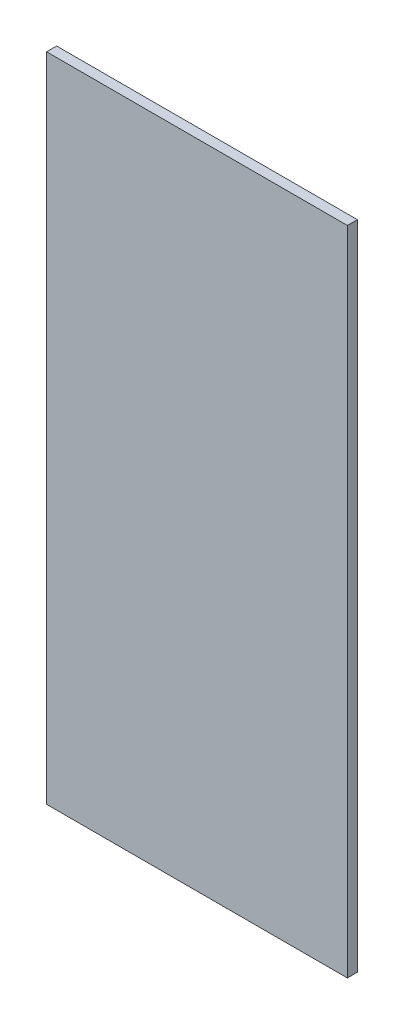
ISO-10303-21;
HEADER;
FILE_DESCRIPTION(('STEP AP214'),'2;1');
FILE_NAME('part.step','',(''),(''),'','','');
FILE_SCHEMA(('AUTOMOTIVE_DESIGN { 1 0 10303 214 1 1 1 1 }'));
ENDSEC;
DATA;
#1=APPLICATION_CONTEXT('core data for automotive mechanical design processes');
#2=APPLICATION_PROTOCOL_DEFINITION('international standard','automotive_design',2000,#1);
#3=PRODUCT_CONTEXT('',#1,'mechanical');
#4=PRODUCT('Part','Part','',(#3));
#5=PRODUCT_RELATED_PRODUCT_CATEGORY('part','',(#4));
#6=PRODUCT_DEFINITION_FORMATION('','',#4);
#7=PRODUCT_DEFINITION_CONTEXT('part definition',#1,'design');
#8=PRODUCT_DEFINITION('design','',#6,#7);
#9=PRODUCT_DEFINITION_SHAPE('','',#8);
#10=(LENGTH_UNIT() NAMED_UNIT(*) SI_UNIT(.MILLI.,.METRE.));
#11=(NAMED_UNIT(*) PLANE_ANGLE_UNIT() SI_UNIT($,.RADIAN.));
#12=(NAMED_UNIT(*) SI_UNIT($,.STERADIAN.) SOLID_ANGLE_UNIT());
#13=UNCERTAINTY_MEASURE_WITH_UNIT(LENGTH_MEASURE(1.E-05),#10,'distance_accuracy_value','');
#14=(GEOMETRIC_REPRESENTATION_CONTEXT(3) GLOBAL_UNCERTAINTY_ASSIGNED_CONTEXT((#13)) GLOBAL_UNIT_ASSIGNED_CONTEXT((#10,
#11,#12)) REPRESENTATION_CONTEXT('',''));
#15=CARTESIAN_POINT('',(0.,0.,0.));
#16=DIRECTION('',(0.,0.,1.));
#17=DIRECTION('',(1.,0.,0.));
#18=AXIS2_PLACEMENT_3D('',#15,#16,#17);
#19=CARTESIAN_POINT('',(0.,82.55,1.27));
#20=DIRECTION('',(-1.,0.,0.));
#21=DIRECTION('',(0.,-1.,0.));
#22=AXIS2_PLACEMENT_3D('',#19,#20,#21);
#23=PLANE('',#22);
#24=DIRECTION('',(0.,1.,0.));
#25=VECTOR('',#24,1.);
#26=CARTESIAN_POINT('',(0.,82.55,0.));
#27=LINE('',#26,#25);
#28=CARTESIAN_POINT('',(0.,0.,0.));
#29=VERTEX_POINT('',#28);
#30=CARTESIAN_POINT('',(0.,82.55,0.));
#31=VERTEX_POINT('',#30);
#32=EDGE_CURVE('E111',#29,#31,#27,.T.);
#33=ORIENTED_EDGE('',*,*,#32,.T.);
#34=DIRECTION('',(0.,0.,-1.));
#35=VECTOR('',#34,1.);
#36=CARTESIAN_POINT('',(0.,82.55,1.27));
#37=LINE('',#36,#35);
#38=CARTESIAN_POINT('',(0.,82.55,1.27));
#39=VERTEX_POINT('',#38);
#40=EDGE_CURVE('E11',#39,#31,#37,.T.);
#41=ORIENTED_EDGE('',*,*,#40,.F.);
#42=DIRECTION('',(0.,1.,0.));
#43=VECTOR('',#42,1.);
#44=CARTESIAN_POINT('',(0.,82.55,1.27));
#45=LINE('',#44,#43);
#46=CARTESIAN_POINT('',(0.,0.,1.27));
#47=VERTEX_POINT('',#46);
#48=EDGE_CURVE('E95',#47,#39,#45,.T.);
#49=ORIENTED_EDGE('',*,*,#48,.F.);
#50=DIRECTION('',(0.,0.,-1.));
#51=VECTOR('',#50,1.);
#52=CARTESIAN_POINT('',(0.,0.,1.27));
#53=LINE('',#52,#51);
#54=EDGE_CURVE('E107',#47,#29,#53,.T.);
#55=ORIENTED_EDGE('',*,*,#54,.T.);
#56=EDGE_LOOP('',(#33,#41,#49,#55));
#57=FACE_BOUND('',#56,.T.);
#58=ADVANCED_FACE('F43',(#57),#23,.F.);
#59=CARTESIAN_POINT('',(-38.1,82.55,1.27));
#60=DIRECTION('',(0.,-1.,0.));
#61=DIRECTION('',(0.,0.,-1.));
#62=AXIS2_PLACEMENT_3D('',#59,#60,#61);
#63=PLANE('',#62);
#64=DIRECTION('',(-1.,0.,0.));
#65=VECTOR('',#64,1.);
#66=CARTESIAN_POINT('',(-38.1,82.55,0.));
#67=LINE('',#66,#65);
#68=CARTESIAN_POINT('',(-38.1,82.55,0.));
#69=VERTEX_POINT('',#68);
#70=EDGE_CURVE('E100',#31,#69,#67,.T.);
#71=ORIENTED_EDGE('',*,*,#70,.T.);
#72=DIRECTION('',(0.,0.,-1.));
#73=VECTOR('',#72,1.);
#74=CARTESIAN_POINT('',(-38.1,82.55,1.27));
#75=LINE('',#74,#73);
#76=CARTESIAN_POINT('',(-38.1,82.55,1.27));
#77=VERTEX_POINT('',#76);
#78=EDGE_CURVE('E52',#77,#69,#75,.T.);
#79=ORIENTED_EDGE('',*,*,#78,.F.);
#80=DIRECTION('',(-1.,0.,0.));
#81=VECTOR('',#80,1.);
#82=CARTESIAN_POINT('',(-38.1,82.55,1.27));
#83=LINE('',#82,#81);
#84=EDGE_CURVE('E90',#39,#77,#83,.T.);
#85=ORIENTED_EDGE('',*,*,#84,.F.);
#86=ORIENTED_EDGE('',*,*,#40,.T.);
#87=EDGE_LOOP('',(#71,#79,#85,#86));
#88=FACE_BOUND('',#87,.T.);
#89=ADVANCED_FACE('F99',(#88),#63,.F.);
#90=CARTESIAN_POINT('',(-38.1,0.,1.27));
#91=DIRECTION('',(1.,0.,0.));
#92=DIRECTION('',(0.,0.,-1.));
#93=AXIS2_PLACEMENT_3D('',#90,#91,#92);
#94=PLANE('',#93);
#95=DIRECTION('',(0.,-1.,0.));
#96=VECTOR('',#95,1.);
#97=CARTESIAN_POINT('',(-38.1,0.,0.));
#98=LINE('',#97,#96);
#99=CARTESIAN_POINT('',(-38.1,0.,0.));
#100=VERTEX_POINT('',#99);
#101=EDGE_CURVE('E77',#69,#100,#98,.T.);
#102=ORIENTED_EDGE('',*,*,#101,.T.);
#103=DIRECTION('',(0.,0.,-1.));
#104=VECTOR('',#103,1.);
#105=CARTESIAN_POINT('',(-38.1,0.,1.27));
#106=LINE('',#105,#104);
#107=CARTESIAN_POINT('',(-38.1,0.,1.27));
#108=VERTEX_POINT('',#107);
#109=EDGE_CURVE('E102',#108,#100,#106,.T.);
#110=ORIENTED_EDGE('',*,*,#109,.F.);
#111=DIRECTION('',(0.,-1.,0.));
#112=VECTOR('',#111,1.);
#113=CARTESIAN_POINT('',(-38.1,0.,1.27));
#114=LINE('',#113,#112);
#115=EDGE_CURVE('E93',#77,#108,#114,.T.);
#116=ORIENTED_EDGE('',*,*,#115,.F.);
#117=ORIENTED_EDGE('',*,*,#78,.T.);
#118=EDGE_LOOP('',(#102,#110,#116,#117));
#119=FACE_BOUND('',#118,.T.);
#120=ADVANCED_FACE('F103',(#119),#94,.F.);
#121=CARTESIAN_POINT('',(0.,0.,1.27));
#122=DIRECTION('',(0.,1.,0.));
#123=DIRECTION('',(-1.,0.,0.));
#124=AXIS2_PLACEMENT_3D('',#121,#122,#123);
#125=PLANE('',#124);
#126=DIRECTION('',(1.,0.,0.));
#127=VECTOR('',#126,1.);
#128=CARTESIAN_POINT('',(0.,0.,0.));
#129=LINE('',#128,#127);
#130=EDGE_CURVE('E83',#100,#29,#129,.T.);
#131=ORIENTED_EDGE('',*,*,#130,.T.);
#132=ORIENTED_EDGE('',*,*,#54,.F.);
#133=DIRECTION('',(1.,0.,0.));
#134=VECTOR('',#133,1.);
#135=CARTESIAN_POINT('',(0.,0.,1.27));
#136=LINE('',#135,#134);
#137=EDGE_CURVE('E60',#108,#47,#136,.T.);
#138=ORIENTED_EDGE('',*,*,#137,.F.);
#139=ORIENTED_EDGE('',*,*,#109,.T.);
#140=EDGE_LOOP('',(#131,#132,#138,#139));
#141=FACE_BOUND('',#140,.T.);
#142=ADVANCED_FACE('F124',(#141),#125,.F.);
#143=CARTESIAN_POINT('',(0.,0.,1.27));
#144=DIRECTION('',(0.,0.,-1.));
#145=DIRECTION('',(-1.,0.,0.));
#146=AXIS2_PLACEMENT_3D('',#143,#144,#145);
#147=PLANE('',#146);
#148=ORIENTED_EDGE('',*,*,#48,.T.);
#149=ORIENTED_EDGE('',*,*,#84,.T.);
#150=ORIENTED_EDGE('',*,*,#115,.T.);
#151=ORIENTED_EDGE('',*,*,#137,.T.);
#152=EDGE_LOOP('',(#148,#149,#150,#151));
#153=FACE_BOUND('',#152,.T.);
#154=ADVANCED_FACE('F91',(#153),#147,.F.);
#155=CARTESIAN_POINT('',(0.,0.,0.));
#156=DIRECTION('',(0.,0.,-1.));
#157=DIRECTION('',(-1.,0.,0.));
#158=AXIS2_PLACEMENT_3D('',#155,#156,#157);
#159=PLANE('',#158);
#160=ORIENTED_EDGE('',*,*,#32,.F.);
#161=ORIENTED_EDGE('',*,*,#130,.F.);
#162=ORIENTED_EDGE('',*,*,#101,.F.);
#163=ORIENTED_EDGE('',*,*,#70,.F.);
#164=EDGE_LOOP('',(#160,#161,#162,#163));
#165=FACE_BOUND('',#164,.T.);
#166=ADVANCED_FACE('F127',(#165),#159,.T.);
#167=CLOSED_SHELL('',(#58,#89,#120,#142,#154,#166));
#168=MANIFOLD_SOLID_BREP('B2',#167);
#169=ADVANCED_BREP_SHAPE_REPRESENTATION('',(#18,#168),#14);
#170=SHAPE_DEFINITION_REPRESENTATION(#9,#169);
ENDSEC;
END-ISO-10303-21;
